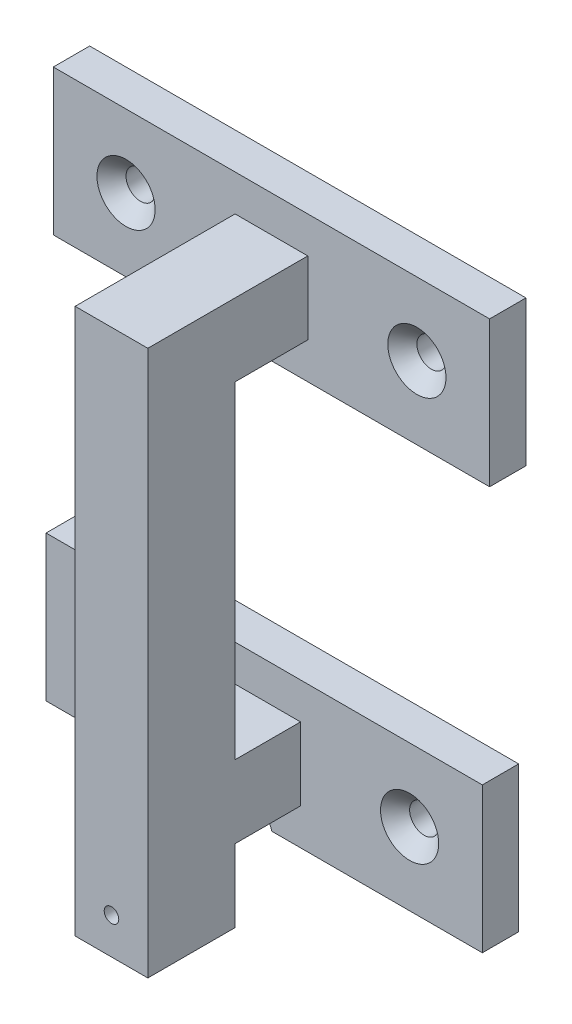
ISO-10303-21;
HEADER;
FILE_DESCRIPTION(('STEP AP214'),'2;1');
FILE_NAME('part.step','',(''),(''),'','','');
FILE_SCHEMA(('AUTOMOTIVE_DESIGN { 1 0 10303 214 1 1 1 1 }'));
ENDSEC;
DATA;
#1=APPLICATION_CONTEXT('core data for automotive mechanical design processes');
#2=APPLICATION_PROTOCOL_DEFINITION('international standard','automotive_design',2000,#1);
#3=PRODUCT_CONTEXT('',#1,'mechanical');
#4=PRODUCT('Part','Part','',(#3));
#5=PRODUCT_RELATED_PRODUCT_CATEGORY('part','',(#4));
#6=PRODUCT_DEFINITION_FORMATION('','',#4);
#7=PRODUCT_DEFINITION_CONTEXT('part definition',#1,'design');
#8=PRODUCT_DEFINITION('design','',#6,#7);
#9=PRODUCT_DEFINITION_SHAPE('','',#8);
#10=(LENGTH_UNIT() NAMED_UNIT(*) SI_UNIT(.MILLI.,.METRE.));
#11=(NAMED_UNIT(*) PLANE_ANGLE_UNIT() SI_UNIT($,.RADIAN.));
#12=(NAMED_UNIT(*) SI_UNIT($,.STERADIAN.) SOLID_ANGLE_UNIT());
#13=UNCERTAINTY_MEASURE_WITH_UNIT(LENGTH_MEASURE(1.E-05),#10,'distance_accuracy_value','');
#14=(GEOMETRIC_REPRESENTATION_CONTEXT(3) GLOBAL_UNCERTAINTY_ASSIGNED_CONTEXT((#13)) GLOBAL_UNIT_ASSIGNED_CONTEXT((#10,
#11,#12)) REPRESENTATION_CONTEXT('',''));
#15=CARTESIAN_POINT('',(0.,0.,0.));
#16=DIRECTION('',(0.,0.,1.));
#17=DIRECTION('',(1.,0.,0.));
#18=AXIS2_PLACEMENT_3D('',#15,#16,#17);
#19=CARTESIAN_POINT('',(-5.,60.,-6.));
#20=DIRECTION('',(0.,0.,-1.));
#21=DIRECTION('',(-1.,0.,0.));
#22=AXIS2_PLACEMENT_3D('',#19,#20,#21);
#23=PLANE('',#22);
#24=DIRECTION('',(0.,-1.,0.));
#25=VECTOR('',#24,1.);
#26=CARTESIAN_POINT('',(-5.,60.,-6.));
#27=LINE('',#26,#25);
#28=CARTESIAN_POINT('',(-5.,50.,-6.));
#29=VERTEX_POINT('',#28);
#30=CARTESIAN_POINT('',(-5.,5.,-6.));
#31=VERTEX_POINT('',#30);
#32=EDGE_CURVE('E50',#29,#31,#27,.T.);
#33=ORIENTED_EDGE('',*,*,#32,.F.);
#34=DIRECTION('',(-1.,0.,0.));
#35=VECTOR('',#34,1.);
#36=CARTESIAN_POINT('',(5.,50.,-6.));
#37=LINE('',#36,#35);
#38=CARTESIAN_POINT('',(5.,50.,-6.));
#39=VERTEX_POINT('',#38);
#40=EDGE_CURVE('E54',#39,#29,#37,.T.);
#41=ORIENTED_EDGE('',*,*,#40,.F.);
#42=DIRECTION('',(0.,-1.,0.));
#43=VECTOR('',#42,1.);
#44=CARTESIAN_POINT('',(5.,60.,-6.));
#45=LINE('',#44,#43);
#46=CARTESIAN_POINT('',(5.,5.,-6.));
#47=VERTEX_POINT('',#46);
#48=EDGE_CURVE('E365',#39,#47,#45,.T.);
#49=ORIENTED_EDGE('',*,*,#48,.T.);
#50=DIRECTION('',(-1.,0.,0.));
#51=VECTOR('',#50,1.);
#52=CARTESIAN_POINT('',(0.,5.,-6.));
#53=LINE('',#52,#51);
#54=EDGE_CURVE('E367',#47,#31,#53,.T.);
#55=ORIENTED_EDGE('',*,*,#54,.T.);
#56=EDGE_LOOP('',(#33,#41,#49,#55));
#57=FACE_BOUND('',#56,.T.);
#58=ADVANCED_FACE('F35',(#57),#23,.T.);
#59=CARTESIAN_POINT('',(30.,-10.,-15.));
#60=DIRECTION('',(0.,-1.,0.));
#61=DIRECTION('',(0.,0.,-1.));
#62=AXIS2_PLACEMENT_3D('',#59,#60,#61);
#63=PLANE('',#62);
#64=DIRECTION('',(0.,0.,1.));
#65=VECTOR('',#64,1.);
#66=CARTESIAN_POINT('',(1.,-10.,-20.));
#67=LINE('',#66,#65);
#68=CARTESIAN_POINT('',(1.,-10.,-20.));
#69=VERTEX_POINT('',#68);
#70=CARTESIAN_POINT('',(1.,-10.,-15.));
#71=VERTEX_POINT('',#70);
#72=EDGE_CURVE('E285',#69,#71,#67,.T.);
#73=ORIENTED_EDGE('',*,*,#72,.F.);
#74=DIRECTION('',(-1.,0.,0.));
#75=VECTOR('',#74,1.);
#76=CARTESIAN_POINT('',(30.,-10.,-20.));
#77=LINE('',#76,#75);
#78=CARTESIAN_POINT('',(30.,-10.,-20.));
#79=VERTEX_POINT('',#78);
#80=EDGE_CURVE('E389',#79,#69,#77,.T.);
#81=ORIENTED_EDGE('',*,*,#80,.F.);
#82=DIRECTION('',(0.,0.,-1.));
#83=VECTOR('',#82,1.);
#84=CARTESIAN_POINT('',(30.,-10.,-15.));
#85=LINE('',#84,#83);
#86=CARTESIAN_POINT('',(30.,-10.,-15.));
#87=VERTEX_POINT('',#86);
#88=EDGE_CURVE('E415',#87,#79,#85,.T.);
#89=ORIENTED_EDGE('',*,*,#88,.F.);
#90=DIRECTION('',(-1.,0.,0.));
#91=VECTOR('',#90,1.);
#92=CARTESIAN_POINT('',(30.,-10.,-15.));
#93=LINE('',#92,#91);
#94=EDGE_CURVE('E396',#87,#71,#93,.T.);
#95=ORIENTED_EDGE('',*,*,#94,.T.);
#96=EDGE_LOOP('',(#73,#81,#89,#95));
#97=FACE_BOUND('',#96,.T.);
#98=ADVANCED_FACE('F514',(#97),#63,.T.);
#99=CARTESIAN_POINT('',(0.,-5.,5.));
#100=DIRECTION('',(0.,1.,0.));
#101=DIRECTION('',(0.,0.,1.));
#102=AXIS2_PLACEMENT_3D('',#99,#100,#101);
#103=PLANE('',#102);
#104=DIRECTION('',(0.,0.,-1.));
#105=VECTOR('',#104,1.);
#106=CARTESIAN_POINT('',(5.,-5.,5.));
#107=LINE('',#106,#105);
#108=CARTESIAN_POINT('',(5.,-5.,-6.));
#109=VERTEX_POINT('',#108);
#110=CARTESIAN_POINT('',(5.,-5.,-15.));
#111=VERTEX_POINT('',#110);
#112=EDGE_CURVE('E434',#109,#111,#107,.T.);
#113=ORIENTED_EDGE('',*,*,#112,.F.);
#114=DIRECTION('',(-1.,0.,0.));
#115=VECTOR('',#114,1.);
#116=CARTESIAN_POINT('',(0.,-5.,-6.));
#117=LINE('',#116,#115);
#118=CARTESIAN_POINT('',(-5.,-5.,-6.));
#119=VERTEX_POINT('',#118);
#120=EDGE_CURVE('E375',#109,#119,#117,.T.);
#121=ORIENTED_EDGE('',*,*,#120,.T.);
#122=DIRECTION('',(0.,0.,-1.));
#123=VECTOR('',#122,1.);
#124=CARTESIAN_POINT('',(-5.,-5.,5.));
#125=LINE('',#124,#123);
#126=CARTESIAN_POINT('',(-5.,-5.,-15.));
#127=VERTEX_POINT('',#126);
#128=EDGE_CURVE('E428',#119,#127,#125,.T.);
#129=ORIENTED_EDGE('',*,*,#128,.T.);
#130=DIRECTION('',(1.,0.,0.));
#131=VECTOR('',#130,1.);
#132=CARTESIAN_POINT('',(0.,-5.,-15.));
#133=LINE('',#132,#131);
#134=EDGE_CURVE('E425',#127,#111,#133,.T.);
#135=ORIENTED_EDGE('',*,*,#134,.T.);
#136=EDGE_LOOP('',(#113,#121,#129,#135));
#137=FACE_BOUND('',#136,.T.);
#138=ADVANCED_FACE('F520',(#137),#103,.F.);
#139=CARTESIAN_POINT('',(5.,0.,5.));
#140=DIRECTION('',(-1.,0.,0.));
#141=DIRECTION('',(0.,0.,1.));
#142=AXIS2_PLACEMENT_3D('',#139,#140,#141);
#143=PLANE('',#142);
#144=CARTESIAN_POINT('',(5.,-15.,-6.));
#145=VERTEX_POINT('',#144);
#146=EDGE_CURVE('E368',#109,#145,#45,.T.);
#147=ORIENTED_EDGE('',*,*,#146,.F.);
#148=ORIENTED_EDGE('',*,*,#112,.T.);
#149=DIRECTION('',(0.,1.,0.));
#150=VECTOR('',#149,1.);
#151=CARTESIAN_POINT('',(5.,0.,-15.));
#152=LINE('',#151,#150);
#153=CARTESIAN_POINT('',(5.,5.,-15.));
#154=VERTEX_POINT('',#153);
#155=EDGE_CURVE('E422',#111,#154,#152,.T.);
#156=ORIENTED_EDGE('',*,*,#155,.T.);
#157=DIRECTION('',(0.,0.,-1.));
#158=VECTOR('',#157,1.);
#159=CARTESIAN_POINT('',(5.,5.,5.));
#160=LINE('',#159,#158);
#161=EDGE_CURVE('E432',#47,#154,#160,.T.);
#162=ORIENTED_EDGE('',*,*,#161,.F.);
#163=ORIENTED_EDGE('',*,*,#48,.F.);
#164=DIRECTION('',(0.,0.,1.));
#165=VECTOR('',#164,1.);
#166=CARTESIAN_POINT('',(5.,50.,-16.));
#167=LINE('',#166,#165);
#168=CARTESIAN_POINT('',(5.,50.,-16.));
#169=VERTEX_POINT('',#168);
#170=EDGE_CURVE('E265',#169,#39,#167,.T.);
#171=ORIENTED_EDGE('',*,*,#170,.F.);
#172=DIRECTION('',(0.,-1.,0.));
#173=VECTOR('',#172,1.);
#174=CARTESIAN_POINT('',(5.,50.,-16.));
#175=LINE('',#174,#173);
#176=CARTESIAN_POINT('',(5.,60.,-16.));
#177=VERTEX_POINT('',#176);
#178=EDGE_CURVE('E256',#177,#169,#175,.T.);
#179=ORIENTED_EDGE('',*,*,#178,.F.);
#180=DIRECTION('',(0.,0.,1.));
#181=VECTOR('',#180,1.);
#182=CARTESIAN_POINT('',(5.,60.,-6.));
#183=LINE('',#182,#181);
#184=CARTESIAN_POINT('',(5.,60.,6.));
#185=VERTEX_POINT('',#184);
#186=EDGE_CURVE('E356',#177,#185,#183,.T.);
#187=ORIENTED_EDGE('',*,*,#186,.T.);
#188=DIRECTION('',(0.,-1.,0.));
#189=VECTOR('',#188,1.);
#190=CARTESIAN_POINT('',(5.,60.,6.));
#191=LINE('',#190,#189);
#192=CARTESIAN_POINT('',(5.,-15.,6.));
#193=VERTEX_POINT('',#192);
#194=EDGE_CURVE('E364',#185,#193,#191,.T.);
#195=ORIENTED_EDGE('',*,*,#194,.T.);
#196=DIRECTION('',(0.,0.,1.));
#197=VECTOR('',#196,1.);
#198=CARTESIAN_POINT('',(5.,-15.,-6.));
#199=LINE('',#198,#197);
#200=EDGE_CURVE('E330',#145,#193,#199,.T.);
#201=ORIENTED_EDGE('',*,*,#200,.F.);
#202=EDGE_LOOP('',(#147,#148,#156,#162,#163,#171,#179,#187,#195,#201));
#203=FACE_BOUND('',#202,.T.);
#204=ADVANCED_FACE('F548',(#203),#143,.F.);
#205=CARTESIAN_POINT('',(0.,5.,5.));
#206=DIRECTION('',(0.,1.,0.));
#207=DIRECTION('',(0.,0.,1.));
#208=AXIS2_PLACEMENT_3D('',#205,#206,#207);
#209=PLANE('',#208);
#210=ORIENTED_EDGE('',*,*,#54,.F.);
#211=ORIENTED_EDGE('',*,*,#161,.T.);
#212=DIRECTION('',(1.,0.,0.));
#213=VECTOR('',#212,1.);
#214=CARTESIAN_POINT('',(0.,5.,-15.));
#215=LINE('',#214,#213);
#216=CARTESIAN_POINT('',(-5.,5.,-15.));
#217=VERTEX_POINT('',#216);
#218=EDGE_CURVE('E414',#217,#154,#215,.T.);
#219=ORIENTED_EDGE('',*,*,#218,.F.);
#220=DIRECTION('',(0.,0.,-1.));
#221=VECTOR('',#220,1.);
#222=CARTESIAN_POINT('',(-5.,5.,5.));
#223=LINE('',#222,#221);
#224=EDGE_CURVE('E430',#31,#217,#223,.T.);
#225=ORIENTED_EDGE('',*,*,#224,.F.);
#226=EDGE_LOOP('',(#210,#211,#219,#225));
#227=FACE_BOUND('',#226,.T.);
#228=ADVANCED_FACE('F558',(#227),#209,.T.);
#229=CARTESIAN_POINT('',(-5.,0.,5.));
#230=DIRECTION('',(-1.,0.,0.));
#231=DIRECTION('',(0.,0.,1.));
#232=AXIS2_PLACEMENT_3D('',#229,#230,#231);
#233=PLANE('',#232);
#234=ORIENTED_EDGE('',*,*,#128,.F.);
#235=CARTESIAN_POINT('',(-5.,-15.,-6.));
#236=VERTEX_POINT('',#235);
#237=EDGE_CURVE('E370',#119,#236,#27,.T.);
#238=ORIENTED_EDGE('',*,*,#237,.T.);
#239=DIRECTION('',(0.,0.,-1.));
#240=VECTOR('',#239,1.);
#241=CARTESIAN_POINT('',(-5.,-15.,-6.));
#242=LINE('',#241,#240);
#243=CARTESIAN_POINT('',(-5.,-15.,6.));
#244=VERTEX_POINT('',#243);
#245=EDGE_CURVE('E350',#244,#236,#242,.T.);
#246=ORIENTED_EDGE('',*,*,#245,.F.);
#247=DIRECTION('',(0.,-1.,0.));
#248=VECTOR('',#247,1.);
#249=CARTESIAN_POINT('',(-5.,60.,6.));
#250=LINE('',#249,#248);
#251=CARTESIAN_POINT('',(-5.,60.,6.));
#252=VERTEX_POINT('',#251);
#253=EDGE_CURVE('E371',#252,#244,#250,.T.);
#254=ORIENTED_EDGE('',*,*,#253,.F.);
#255=DIRECTION('',(0.,0.,-1.));
#256=VECTOR('',#255,1.);
#257=CARTESIAN_POINT('',(-5.,60.,-6.));
#258=LINE('',#257,#256);
#259=CARTESIAN_POINT('',(-5.,60.,-16.));
#260=VERTEX_POINT('',#259);
#261=EDGE_CURVE('E362',#252,#260,#258,.T.);
#262=ORIENTED_EDGE('',*,*,#261,.T.);
#263=DIRECTION('',(0.,1.,0.));
#264=VECTOR('',#263,1.);
#265=CARTESIAN_POINT('',(-5.,50.,-16.));
#266=LINE('',#265,#264);
#267=CARTESIAN_POINT('',(-5.,50.,-16.));
#268=VERTEX_POINT('',#267);
#269=EDGE_CURVE('E245',#268,#260,#266,.T.);
#270=ORIENTED_EDGE('',*,*,#269,.F.);
#271=DIRECTION('',(0.,0.,1.));
#272=VECTOR('',#271,1.);
#273=CARTESIAN_POINT('',(-5.,50.,-16.));
#274=LINE('',#273,#272);
#275=EDGE_CURVE('E261',#268,#29,#274,.T.);
#276=ORIENTED_EDGE('',*,*,#275,.T.);
#277=ORIENTED_EDGE('',*,*,#32,.T.);
#278=ORIENTED_EDGE('',*,*,#224,.T.);
#279=DIRECTION('',(0.,1.,0.));
#280=VECTOR('',#279,1.);
#281=CARTESIAN_POINT('',(-5.,0.,-15.));
#282=LINE('',#281,#280);
#283=EDGE_CURVE('E436',#127,#217,#282,.T.);
#284=ORIENTED_EDGE('',*,*,#283,.F.);
#285=EDGE_LOOP('',(#234,#238,#246,#254,#262,#270,#276,#277,#278,#284));
#286=FACE_BOUND('',#285,.T.);
#287=ADVANCED_FACE('F561',(#286),#233,.T.);
#288=CARTESIAN_POINT('',(0.,0.,-15.));
#289=DIRECTION('',(0.,0.,1.));
#290=DIRECTION('',(1.,0.,0.));
#291=AXIS2_PLACEMENT_3D('',#288,#289,#290);
#292=PLANE('',#291);
#293=CARTESIAN_POINT('',(-20.,0.,-15.));
#294=DIRECTION('',(0.,0.,1.));
#295=DIRECTION('',(1.,0.,0.));
#296=AXIS2_PLACEMENT_3D('',#293,#294,#295);
#297=CIRCLE('',#296,4.);
#298=CARTESIAN_POINT('',(-16.,0.,-15.));
#299=VERTEX_POINT('',#298);
#300=EDGE_CURVE('E444',#299,#299,#297,.F.);
#301=ORIENTED_EDGE('',*,*,#300,.T.);
#302=EDGE_LOOP('',(#301));
#303=FACE_BOUND('',#302,.T.);
#304=CARTESIAN_POINT('',(20.,0.,-15.));
#305=DIRECTION('',(0.,0.,1.));
#306=DIRECTION('',(1.,0.,0.));
#307=AXIS2_PLACEMENT_3D('',#304,#305,#306);
#308=CIRCLE('',#307,4.);
#309=CARTESIAN_POINT('',(24.,0.,-15.));
#310=VERTEX_POINT('',#309);
#311=EDGE_CURVE('E439',#310,#310,#308,.F.);
#312=ORIENTED_EDGE('',*,*,#311,.T.);
#313=EDGE_LOOP('',(#312));
#314=FACE_BOUND('',#313,.T.);
#315=CARTESIAN_POINT('',(0.,-10.,-15.));
#316=DIRECTION('',(0.,0.,1.));
#317=DIRECTION('',(1.,0.,0.));
#318=AXIS2_PLACEMENT_3D('',#315,#316,#317);
#319=CIRCLE('',#318,1.);
#320=CARTESIAN_POINT('',(-0.999999999999999,-10.,-15.));
#321=VERTEX_POINT('',#320);
#322=EDGE_CURVE('E283',#71,#321,#319,.T.);
#323=ORIENTED_EDGE('',*,*,#322,.F.);
#324=ORIENTED_EDGE('',*,*,#94,.F.);
#325=DIRECTION('',(0.,-1.,0.));
#326=VECTOR('',#325,1.);
#327=CARTESIAN_POINT('',(30.,-10.,-15.));
#328=LINE('',#327,#326);
#329=CARTESIAN_POINT('',(30.,10.,-15.));
#330=VERTEX_POINT('',#329);
#331=EDGE_CURVE('E392',#330,#87,#328,.T.);
#332=ORIENTED_EDGE('',*,*,#331,.F.);
#333=DIRECTION('',(1.,0.,0.));
#334=VECTOR('',#333,1.);
#335=CARTESIAN_POINT('',(30.,10.,-15.));
#336=LINE('',#335,#334);
#337=CARTESIAN_POINT('',(-30.,10.,-15.));
#338=VERTEX_POINT('',#337);
#339=EDGE_CURVE('E388',#338,#330,#336,.T.);
#340=ORIENTED_EDGE('',*,*,#339,.F.);
#341=DIRECTION('',(0.,1.,0.));
#342=VECTOR('',#341,1.);
#343=CARTESIAN_POINT('',(-30.,-10.,-15.));
#344=LINE('',#343,#342);
#345=CARTESIAN_POINT('',(-30.,-10.,-15.));
#346=VERTEX_POINT('',#345);
#347=EDGE_CURVE('E385',#346,#338,#344,.T.);
#348=ORIENTED_EDGE('',*,*,#347,.F.);
#349=EDGE_CURVE('E395',#321,#346,#93,.T.);
#350=ORIENTED_EDGE('',*,*,#349,.F.);
#351=EDGE_LOOP('',(#323,#324,#332,#340,#348,#350));
#352=FACE_BOUND('',#351,.T.);
#353=ORIENTED_EDGE('',*,*,#134,.F.);
#354=ORIENTED_EDGE('',*,*,#283,.T.);
#355=ORIENTED_EDGE('',*,*,#218,.T.);
#356=ORIENTED_EDGE('',*,*,#155,.F.);
#357=EDGE_LOOP('',(#353,#354,#355,#356));
#358=FACE_BOUND('',#357,.T.);
#359=ADVANCED_FACE('F553',(#303,#314,#352,#358),#292,.T.);
#360=CARTESIAN_POINT('',(-30.,-10.,-15.));
#361=DIRECTION('',(-1.,0.,0.));
#362=DIRECTION('',(0.,0.,1.));
#363=AXIS2_PLACEMENT_3D('',#360,#361,#362);
#364=PLANE('',#363);
#365=DIRECTION('',(0.,1.,0.));
#366=VECTOR('',#365,1.);
#367=CARTESIAN_POINT('',(-30.,-10.,-20.));
#368=LINE('',#367,#366);
#369=CARTESIAN_POINT('',(-30.,-10.,-20.));
#370=VERTEX_POINT('',#369);
#371=CARTESIAN_POINT('',(-30.,10.,-20.));
#372=VERTEX_POINT('',#371);
#373=EDGE_CURVE('E384',#370,#372,#368,.T.);
#374=ORIENTED_EDGE('',*,*,#373,.F.);
#375=DIRECTION('',(0.,0.,-1.));
#376=VECTOR('',#375,1.);
#377=CARTESIAN_POINT('',(-30.,-10.,-15.));
#378=LINE('',#377,#376);
#379=EDGE_CURVE('E411',#346,#370,#378,.T.);
#380=ORIENTED_EDGE('',*,*,#379,.F.);
#381=ORIENTED_EDGE('',*,*,#347,.T.);
#382=DIRECTION('',(0.,0.,-1.));
#383=VECTOR('',#382,1.);
#384=CARTESIAN_POINT('',(-30.,10.,-15.));
#385=LINE('',#384,#383);
#386=EDGE_CURVE('E399',#338,#372,#385,.T.);
#387=ORIENTED_EDGE('',*,*,#386,.T.);
#388=EDGE_LOOP('',(#374,#380,#381,#387));
#389=FACE_BOUND('',#388,.T.);
#390=ADVANCED_FACE('F658',(#389),#364,.T.);
#391=DIRECTION('',(0.,0.,1.));
#392=VECTOR('',#391,1.);
#393=CARTESIAN_POINT('',(-0.999999999999999,-10.,-20.));
#394=LINE('',#393,#392);
#395=CARTESIAN_POINT('',(-0.999999999999999,-10.,-20.));
#396=VERTEX_POINT('',#395);
#397=EDGE_CURVE('E281',#321,#396,#394,.F.);
#398=ORIENTED_EDGE('',*,*,#397,.F.);
#399=ORIENTED_EDGE('',*,*,#349,.T.);
#400=ORIENTED_EDGE('',*,*,#379,.T.);
#401=EDGE_CURVE('E408',#396,#370,#77,.T.);
#402=ORIENTED_EDGE('',*,*,#401,.F.);
#403=EDGE_LOOP('',(#398,#399,#400,#402));
#404=FACE_BOUND('',#403,.T.);
#405=ADVANCED_FACE('F523',(#404),#63,.T.);
#406=CARTESIAN_POINT('',(30.,-10.,-15.));
#407=DIRECTION('',(1.,0.,0.));
#408=DIRECTION('',(0.,0.,-1.));
#409=AXIS2_PLACEMENT_3D('',#406,#407,#408);
#410=PLANE('',#409);
#411=DIRECTION('',(0.,-1.,0.));
#412=VECTOR('',#411,1.);
#413=CARTESIAN_POINT('',(30.,-10.,-20.));
#414=LINE('',#413,#412);
#415=CARTESIAN_POINT('',(30.,10.,-20.));
#416=VERTEX_POINT('',#415);
#417=EDGE_CURVE('E405',#416,#79,#414,.T.);
#418=ORIENTED_EDGE('',*,*,#417,.F.);
#419=DIRECTION('',(0.,0.,-1.));
#420=VECTOR('',#419,1.);
#421=CARTESIAN_POINT('',(30.,10.,-15.));
#422=LINE('',#421,#420);
#423=EDGE_CURVE('E417',#330,#416,#422,.T.);
#424=ORIENTED_EDGE('',*,*,#423,.F.);
#425=ORIENTED_EDGE('',*,*,#331,.T.);
#426=ORIENTED_EDGE('',*,*,#88,.T.);
#427=EDGE_LOOP('',(#418,#424,#425,#426));
#428=FACE_BOUND('',#427,.T.);
#429=ADVANCED_FACE('F666',(#428),#410,.T.);
#430=CARTESIAN_POINT('',(30.,10.,-15.));
#431=DIRECTION('',(0.,1.,0.));
#432=DIRECTION('',(0.,0.,1.));
#433=AXIS2_PLACEMENT_3D('',#430,#431,#432);
#434=PLANE('',#433);
#435=DIRECTION('',(1.,0.,0.));
#436=VECTOR('',#435,1.);
#437=CARTESIAN_POINT('',(30.,10.,-20.));
#438=LINE('',#437,#436);
#439=EDGE_CURVE('E402',#372,#416,#438,.T.);
#440=ORIENTED_EDGE('',*,*,#439,.F.);
#441=ORIENTED_EDGE('',*,*,#386,.F.);
#442=ORIENTED_EDGE('',*,*,#339,.T.);
#443=ORIENTED_EDGE('',*,*,#423,.T.);
#444=EDGE_LOOP('',(#440,#441,#442,#443));
#445=FACE_BOUND('',#444,.T.);
#446=ADVANCED_FACE('F662',(#445),#434,.T.);
#447=CARTESIAN_POINT('',(-20.,0.,-15.));
#448=DIRECTION('',(0.,0.,-1.));
#449=DIRECTION('',(-1.,0.,0.));
#450=AXIS2_PLACEMENT_3D('',#447,#448,#449);
#451=CYLINDRICAL_SURFACE('',#450,2.);
#452=CARTESIAN_POINT('',(-20.,0.,-17.));
#453=DIRECTION('',(0.,0.,1.));
#454=DIRECTION('',(1.,0.,0.));
#455=AXIS2_PLACEMENT_3D('',#452,#453,#454);
#456=CIRCLE('',#455,2.);
#457=CARTESIAN_POINT('',(-18.,0.,-17.));
#458=VERTEX_POINT('',#457);
#459=EDGE_CURVE('E447',#458,#458,#456,.T.);
#460=ORIENTED_EDGE('',*,*,#459,.T.);
#461=EDGE_LOOP('',(#460));
#462=FACE_BOUND('',#461,.T.);
#463=CARTESIAN_POINT('',(-20.,0.,-20.));
#464=DIRECTION('',(0.,0.,-1.));
#465=DIRECTION('',(-1.,0.,0.));
#466=AXIS2_PLACEMENT_3D('',#463,#464,#465);
#467=CIRCLE('',#466,2.);
#468=CARTESIAN_POINT('',(-22.,0.,-20.));
#469=VERTEX_POINT('',#468);
#470=EDGE_CURVE('E381',#469,#469,#467,.T.);
#471=ORIENTED_EDGE('',*,*,#470,.T.);
#472=EDGE_LOOP('',(#471));
#473=FACE_BOUND('',#472,.T.);
#474=ADVANCED_FACE('F665',(#462,#473),#451,.F.);
#475=CARTESIAN_POINT('',(20.,0.,-15.));
#476=DIRECTION('',(0.,0.,-1.));
#477=DIRECTION('',(-1.,0.,0.));
#478=AXIS2_PLACEMENT_3D('',#475,#476,#477);
#479=CYLINDRICAL_SURFACE('',#478,2.);
#480=CARTESIAN_POINT('',(20.,0.,-17.));
#481=DIRECTION('',(0.,0.,1.));
#482=DIRECTION('',(1.,0.,0.));
#483=AXIS2_PLACEMENT_3D('',#480,#481,#482);
#484=CIRCLE('',#483,2.);
#485=CARTESIAN_POINT('',(22.,0.,-17.));
#486=VERTEX_POINT('',#485);
#487=EDGE_CURVE('E11',#486,#486,#484,.T.);
#488=ORIENTED_EDGE('',*,*,#487,.T.);
#489=EDGE_LOOP('',(#488));
#490=FACE_BOUND('',#489,.T.);
#491=CARTESIAN_POINT('',(20.,0.,-20.));
#492=DIRECTION('',(0.,0.,-1.));
#493=DIRECTION('',(1.,0.,0.));
#494=AXIS2_PLACEMENT_3D('',#491,#492,#493);
#495=CIRCLE('',#494,2.);
#496=CARTESIAN_POINT('',(22.,0.,-20.));
#497=VERTEX_POINT('',#496);
#498=EDGE_CURVE('E378',#497,#497,#495,.T.);
#499=ORIENTED_EDGE('',*,*,#498,.T.);
#500=EDGE_LOOP('',(#499));
#501=FACE_BOUND('',#500,.T.);
#502=ADVANCED_FACE('F536',(#490,#501),#479,.F.);
#503=CARTESIAN_POINT('',(0.,0.,-20.));
#504=DIRECTION('',(0.,0.,1.));
#505=DIRECTION('',(1.,0.,0.));
#506=AXIS2_PLACEMENT_3D('',#503,#504,#505);
#507=PLANE('',#506);
#508=ORIENTED_EDGE('',*,*,#498,.F.);
#509=EDGE_LOOP('',(#508));
#510=FACE_BOUND('',#509,.T.);
#511=ORIENTED_EDGE('',*,*,#470,.F.);
#512=EDGE_LOOP('',(#511));
#513=FACE_BOUND('',#512,.T.);
#514=ORIENTED_EDGE('',*,*,#80,.T.);
#515=CARTESIAN_POINT('',(0.,-10.,-20.));
#516=DIRECTION('',(0.,0.,1.));
#517=DIRECTION('',(1.,0.,0.));
#518=AXIS2_PLACEMENT_3D('',#515,#516,#517);
#519=CIRCLE('',#518,1.);
#520=EDGE_CURVE('E269',#69,#396,#519,.T.);
#521=ORIENTED_EDGE('',*,*,#520,.T.);
#522=ORIENTED_EDGE('',*,*,#401,.T.);
#523=ORIENTED_EDGE('',*,*,#373,.T.);
#524=ORIENTED_EDGE('',*,*,#439,.T.);
#525=ORIENTED_EDGE('',*,*,#417,.T.);
#526=EDGE_LOOP('',(#514,#521,#522,#523,#524,#525));
#527=FACE_BOUND('',#526,.T.);
#528=ADVANCED_FACE('F528',(#510,#513,#527),#507,.F.);
#529=CARTESIAN_POINT('',(0.,-10.,-6.));
#530=DIRECTION('',(0.,0.,-1.));
#531=DIRECTION('',(-1.,0.,0.));
#532=AXIS2_PLACEMENT_3D('',#529,#530,#531);
#533=CIRCLE('',#532,1.);
#534=CARTESIAN_POINT('',(-0.999999999999999,-10.,-6.));
#535=VERTEX_POINT('',#534);
#536=EDGE_CURVE('E278',#535,#535,#533,.T.);
#537=ORIENTED_EDGE('',*,*,#536,.F.);
#538=EDGE_LOOP('',(#537));
#539=FACE_BOUND('',#538,.T.);
#540=ORIENTED_EDGE('',*,*,#120,.F.);
#541=ORIENTED_EDGE('',*,*,#146,.T.);
#542=DIRECTION('',(1.,0.,0.));
#543=VECTOR('',#542,1.);
#544=CARTESIAN_POINT('',(-5.,-15.,-6.));
#545=LINE('',#544,#543);
#546=EDGE_CURVE('E353',#236,#145,#545,.T.);
#547=ORIENTED_EDGE('',*,*,#546,.F.);
#548=ORIENTED_EDGE('',*,*,#237,.F.);
#549=EDGE_LOOP('',(#540,#541,#547,#548));
#550=FACE_BOUND('',#549,.T.);
#551=ADVANCED_FACE('F516',(#539,#550),#23,.T.);
#552=CARTESIAN_POINT('',(-5.,60.,6.));
#553=DIRECTION('',(0.,0.,1.));
#554=DIRECTION('',(1.,0.,0.));
#555=AXIS2_PLACEMENT_3D('',#552,#553,#554);
#556=PLANE('',#555);
#557=CARTESIAN_POINT('',(0.,-10.,6.));
#558=DIRECTION('',(0.,0.,1.));
#559=DIRECTION('',(1.,0.,0.));
#560=AXIS2_PLACEMENT_3D('',#557,#558,#559);
#561=CIRCLE('',#560,1.);
#562=CARTESIAN_POINT('',(1.,-10.,6.));
#563=VERTEX_POINT('',#562);
#564=EDGE_CURVE('E268',#563,#563,#561,.T.);
#565=ORIENTED_EDGE('',*,*,#564,.F.);
#566=EDGE_LOOP('',(#565));
#567=FACE_BOUND('',#566,.T.);
#568=ORIENTED_EDGE('',*,*,#253,.T.);
#569=DIRECTION('',(-1.,0.,0.));
#570=VECTOR('',#569,1.);
#571=CARTESIAN_POINT('',(-5.,-15.,6.));
#572=LINE('',#571,#570);
#573=EDGE_CURVE('E347',#193,#244,#572,.T.);
#574=ORIENTED_EDGE('',*,*,#573,.F.);
#575=ORIENTED_EDGE('',*,*,#194,.F.);
#576=DIRECTION('',(-1.,0.,0.));
#577=VECTOR('',#576,1.);
#578=CARTESIAN_POINT('',(-5.,60.,6.));
#579=LINE('',#578,#577);
#580=EDGE_CURVE('E359',#185,#252,#579,.T.);
#581=ORIENTED_EDGE('',*,*,#580,.T.);
#582=EDGE_LOOP('',(#568,#574,#575,#581));
#583=FACE_BOUND('',#582,.T.);
#584=ADVANCED_FACE('F527',(#567,#583),#556,.T.);
#585=CARTESIAN_POINT('',(0.,60.,0.));
#586=DIRECTION('',(0.,1.,0.));
#587=DIRECTION('',(0.,0.,1.));
#588=AXIS2_PLACEMENT_3D('',#585,#586,#587);
#589=PLANE('',#588);
#590=ORIENTED_EDGE('',*,*,#186,.F.);
#591=DIRECTION('',(1.,0.,0.));
#592=VECTOR('',#591,1.);
#593=CARTESIAN_POINT('',(5.,60.,-16.));
#594=LINE('',#593,#592);
#595=EDGE_CURVE('E253',#260,#177,#594,.T.);
#596=ORIENTED_EDGE('',*,*,#595,.F.);
#597=ORIENTED_EDGE('',*,*,#261,.F.);
#598=ORIENTED_EDGE('',*,*,#580,.F.);
#599=EDGE_LOOP('',(#590,#596,#597,#598));
#600=FACE_BOUND('',#599,.T.);
#601=ADVANCED_FACE('F534',(#600),#589,.T.);
#602=CARTESIAN_POINT('',(0.,-15.,0.));
#603=DIRECTION('',(0.,1.,0.));
#604=DIRECTION('',(0.,0.,1.));
#605=AXIS2_PLACEMENT_3D('',#602,#603,#604);
#606=PLANE('',#605);
#607=DIRECTION('',(0.,0.,1.));
#608=VECTOR('',#607,1.);
#609=CARTESIAN_POINT('',(2.05,-15.,0.));
#610=LINE('',#609,#608);
#611=CARTESIAN_POINT('',(2.05,-15.,-1.55));
#612=VERTEX_POINT('',#611);
#613=CARTESIAN_POINT('',(2.05,-15.,-1.05));
#614=VERTEX_POINT('',#613);
#615=EDGE_CURVE('E310',#612,#614,#610,.T.);
#616=ORIENTED_EDGE('',*,*,#615,.F.);
#617=DIRECTION('',(1.,0.,0.));
#618=VECTOR('',#617,1.);
#619=CARTESIAN_POINT('',(0.,-15.,-1.55));
#620=LINE('',#619,#618);
#621=CARTESIAN_POINT('',(-2.05,-15.,-1.55));
#622=VERTEX_POINT('',#621);
#623=EDGE_CURVE('E287',#622,#612,#620,.T.);
#624=ORIENTED_EDGE('',*,*,#623,.F.);
#625=DIRECTION('',(0.,0.,1.));
#626=VECTOR('',#625,1.);
#627=CARTESIAN_POINT('',(-2.05,-15.,0.));
#628=LINE('',#627,#626);
#629=CARTESIAN_POINT('',(-2.05,-15.,1.55));
#630=VERTEX_POINT('',#629);
#631=EDGE_CURVE('E292',#622,#630,#628,.T.);
#632=ORIENTED_EDGE('',*,*,#631,.T.);
#633=DIRECTION('',(1.,0.,0.));
#634=VECTOR('',#633,1.);
#635=CARTESIAN_POINT('',(0.,-15.,1.55));
#636=LINE('',#635,#634);
#637=CARTESIAN_POINT('',(2.05,-15.,1.55));
#638=VERTEX_POINT('',#637);
#639=EDGE_CURVE('E323',#630,#638,#636,.T.);
#640=ORIENTED_EDGE('',*,*,#639,.T.);
#641=CARTESIAN_POINT('',(2.05,-15.,1.05));
#642=VERTEX_POINT('',#641);
#643=EDGE_CURVE('E314',#642,#638,#610,.T.);
#644=ORIENTED_EDGE('',*,*,#643,.F.);
#645=DIRECTION('',(1.,0.,0.));
#646=VECTOR('',#645,1.);
#647=CARTESIAN_POINT('',(0.,-15.,1.05));
#648=LINE('',#647,#646);
#649=CARTESIAN_POINT('',(3.65,-15.,1.05));
#650=VERTEX_POINT('',#649);
#651=EDGE_CURVE('E320',#642,#650,#648,.T.);
#652=ORIENTED_EDGE('',*,*,#651,.T.);
#653=DIRECTION('',(0.,0.,1.));
#654=VECTOR('',#653,1.);
#655=CARTESIAN_POINT('',(3.65,-15.,0.));
#656=LINE('',#655,#654);
#657=CARTESIAN_POINT('',(3.65,-15.,-1.05));
#658=VERTEX_POINT('',#657);
#659=EDGE_CURVE('E317',#658,#650,#656,.T.);
#660=ORIENTED_EDGE('',*,*,#659,.F.);
#661=DIRECTION('',(1.,0.,0.));
#662=VECTOR('',#661,1.);
#663=CARTESIAN_POINT('',(0.,-15.,-1.05));
#664=LINE('',#663,#662);
#665=EDGE_CURVE('E313',#614,#658,#664,.T.);
#666=ORIENTED_EDGE('',*,*,#665,.F.);
#667=EDGE_LOOP('',(#616,#624,#632,#640,#644,#652,#660,#666));
#668=FACE_BOUND('',#667,.T.);
#669=ORIENTED_EDGE('',*,*,#200,.T.);
#670=ORIENTED_EDGE('',*,*,#573,.T.);
#671=ORIENTED_EDGE('',*,*,#245,.T.);
#672=ORIENTED_EDGE('',*,*,#546,.T.);
#673=EDGE_LOOP('',(#669,#670,#671,#672));
#674=FACE_BOUND('',#673,.T.);
#675=ADVANCED_FACE('F572',(#668,#674),#606,.F.);
#676=CARTESIAN_POINT('',(0.,-2.,-1.55));
#677=DIRECTION('',(0.,0.,-1.));
#678=DIRECTION('',(-1.,0.,0.));
#679=AXIS2_PLACEMENT_3D('',#676,#677,#678);
#680=PLANE('',#679);
#681=CARTESIAN_POINT('',(0.,-10.,-1.55));
#682=DIRECTION('',(0.,0.,-1.));
#683=DIRECTION('',(-1.,0.,0.));
#684=AXIS2_PLACEMENT_3D('',#681,#682,#683);
#685=CIRCLE('',#684,1.);
#686=CARTESIAN_POINT('',(-0.999999999999999,-10.,-1.55));
#687=VERTEX_POINT('',#686);
#688=EDGE_CURVE('E275',#687,#687,#685,.T.);
#689=ORIENTED_EDGE('',*,*,#688,.T.);
#690=EDGE_LOOP('',(#689));
#691=FACE_BOUND('',#690,.T.);
#692=ORIENTED_EDGE('',*,*,#623,.T.);
#693=DIRECTION('',(0.,-1.,0.));
#694=VECTOR('',#693,1.);
#695=CARTESIAN_POINT('',(2.05,-2.,-1.55));
#696=LINE('',#695,#694);
#697=CARTESIAN_POINT('',(2.05,-2.,-1.55));
#698=VERTEX_POINT('',#697);
#699=EDGE_CURVE('E308',#698,#612,#696,.T.);
#700=ORIENTED_EDGE('',*,*,#699,.F.);
#701=DIRECTION('',(1.,0.,0.));
#702=VECTOR('',#701,1.);
#703=CARTESIAN_POINT('',(0.,-2.,-1.55));
#704=LINE('',#703,#702);
#705=CARTESIAN_POINT('',(-2.05,-2.,-1.55));
#706=VERTEX_POINT('',#705);
#707=EDGE_CURVE('E288',#706,#698,#704,.T.);
#708=ORIENTED_EDGE('',*,*,#707,.F.);
#709=DIRECTION('',(0.,-1.,0.));
#710=VECTOR('',#709,1.);
#711=CARTESIAN_POINT('',(-2.05,-2.,-1.55));
#712=LINE('',#711,#710);
#713=EDGE_CURVE('E328',#706,#622,#712,.T.);
#714=ORIENTED_EDGE('',*,*,#713,.T.);
#715=EDGE_LOOP('',(#692,#700,#708,#714));
#716=FACE_BOUND('',#715,.T.);
#717=ADVANCED_FACE('F574',(#691,#716),#680,.F.);
#718=CARTESIAN_POINT('',(-2.05,-2.,0.));
#719=DIRECTION('',(1.,0.,0.));
#720=DIRECTION('',(0.,0.,-1.));
#721=AXIS2_PLACEMENT_3D('',#718,#719,#720);
#722=PLANE('',#721);
#723=ORIENTED_EDGE('',*,*,#631,.F.);
#724=ORIENTED_EDGE('',*,*,#713,.F.);
#725=DIRECTION('',(0.,0.,1.));
#726=VECTOR('',#725,1.);
#727=CARTESIAN_POINT('',(-2.05,-2.,0.));
#728=LINE('',#727,#726);
#729=CARTESIAN_POINT('',(-2.05,-2.,1.55));
#730=VERTEX_POINT('',#729);
#731=EDGE_CURVE('E306',#706,#730,#728,.T.);
#732=ORIENTED_EDGE('',*,*,#731,.T.);
#733=DIRECTION('',(0.,-1.,0.));
#734=VECTOR('',#733,1.);
#735=CARTESIAN_POINT('',(-2.05,-2.,1.55));
#736=LINE('',#735,#734);
#737=EDGE_CURVE('E331',#730,#630,#736,.T.);
#738=ORIENTED_EDGE('',*,*,#737,.T.);
#739=EDGE_LOOP('',(#723,#724,#732,#738));
#740=FACE_BOUND('',#739,.T.);
#741=ADVANCED_FACE('F581',(#740),#722,.T.);
#742=CARTESIAN_POINT('',(0.,-2.,1.55));
#743=DIRECTION('',(0.,0.,-1.));
#744=DIRECTION('',(-1.,0.,0.));
#745=AXIS2_PLACEMENT_3D('',#742,#743,#744);
#746=PLANE('',#745);
#747=CARTESIAN_POINT('',(0.,-10.,1.55));
#748=DIRECTION('',(0.,0.,-1.));
#749=DIRECTION('',(-1.,0.,0.));
#750=AXIS2_PLACEMENT_3D('',#747,#748,#749);
#751=CIRCLE('',#750,1.);
#752=CARTESIAN_POINT('',(-0.999999999999999,-10.,1.55));
#753=VERTEX_POINT('',#752);
#754=EDGE_CURVE('E272',#753,#753,#751,.T.);
#755=ORIENTED_EDGE('',*,*,#754,.F.);
#756=EDGE_LOOP('',(#755));
#757=FACE_BOUND('',#756,.T.);
#758=ORIENTED_EDGE('',*,*,#639,.F.);
#759=ORIENTED_EDGE('',*,*,#737,.F.);
#760=DIRECTION('',(1.,0.,0.));
#761=VECTOR('',#760,1.);
#762=CARTESIAN_POINT('',(0.,-2.,1.55));
#763=LINE('',#762,#761);
#764=CARTESIAN_POINT('',(2.05,-2.,1.55));
#765=VERTEX_POINT('',#764);
#766=EDGE_CURVE('E304',#730,#765,#763,.T.);
#767=ORIENTED_EDGE('',*,*,#766,.T.);
#768=DIRECTION('',(0.,-1.,0.));
#769=VECTOR('',#768,1.);
#770=CARTESIAN_POINT('',(2.05,-2.,1.55));
#771=LINE('',#770,#769);
#772=EDGE_CURVE('E333',#765,#638,#771,.T.);
#773=ORIENTED_EDGE('',*,*,#772,.T.);
#774=EDGE_LOOP('',(#758,#759,#767,#773));
#775=FACE_BOUND('',#774,.T.);
#776=ADVANCED_FACE('F602',(#757,#775),#746,.T.);
#777=CARTESIAN_POINT('',(2.05,-2.,0.));
#778=DIRECTION('',(1.,0.,0.));
#779=DIRECTION('',(0.,0.,-1.));
#780=AXIS2_PLACEMENT_3D('',#777,#778,#779);
#781=PLANE('',#780);
#782=ORIENTED_EDGE('',*,*,#643,.T.);
#783=ORIENTED_EDGE('',*,*,#772,.F.);
#784=DIRECTION('',(0.,0.,1.));
#785=VECTOR('',#784,1.);
#786=CARTESIAN_POINT('',(2.05,-2.,0.));
#787=LINE('',#786,#785);
#788=CARTESIAN_POINT('',(2.05,-2.,1.05));
#789=VERTEX_POINT('',#788);
#790=EDGE_CURVE('E296',#789,#765,#787,.T.);
#791=ORIENTED_EDGE('',*,*,#790,.F.);
#792=DIRECTION('',(0.,-1.,0.));
#793=VECTOR('',#792,1.);
#794=CARTESIAN_POINT('',(2.05,-2.,1.05));
#795=LINE('',#794,#793);
#796=EDGE_CURVE('E335',#789,#642,#795,.T.);
#797=ORIENTED_EDGE('',*,*,#796,.T.);
#798=EDGE_LOOP('',(#782,#783,#791,#797));
#799=FACE_BOUND('',#798,.T.);
#800=ADVANCED_FACE('F598',(#799),#781,.F.);
#801=CARTESIAN_POINT('',(0.,-2.,1.05));
#802=DIRECTION('',(0.,0.,-1.));
#803=DIRECTION('',(-1.,0.,0.));
#804=AXIS2_PLACEMENT_3D('',#801,#802,#803);
#805=PLANE('',#804);
#806=ORIENTED_EDGE('',*,*,#651,.F.);
#807=ORIENTED_EDGE('',*,*,#796,.F.);
#808=DIRECTION('',(1.,0.,0.));
#809=VECTOR('',#808,1.);
#810=CARTESIAN_POINT('',(0.,-2.,1.05));
#811=LINE('',#810,#809);
#812=CARTESIAN_POINT('',(3.65,-2.,1.05));
#813=VERTEX_POINT('',#812);
#814=EDGE_CURVE('E302',#789,#813,#811,.T.);
#815=ORIENTED_EDGE('',*,*,#814,.T.);
#816=DIRECTION('',(0.,-1.,0.));
#817=VECTOR('',#816,1.);
#818=CARTESIAN_POINT('',(3.65,-2.,1.05));
#819=LINE('',#818,#817);
#820=EDGE_CURVE('E337',#813,#650,#819,.T.);
#821=ORIENTED_EDGE('',*,*,#820,.T.);
#822=EDGE_LOOP('',(#806,#807,#815,#821));
#823=FACE_BOUND('',#822,.T.);
#824=ADVANCED_FACE('F594',(#823),#805,.T.);
#825=CARTESIAN_POINT('',(3.65,-2.,0.));
#826=DIRECTION('',(1.,0.,0.));
#827=DIRECTION('',(0.,0.,-1.));
#828=AXIS2_PLACEMENT_3D('',#825,#826,#827);
#829=PLANE('',#828);
#830=ORIENTED_EDGE('',*,*,#659,.T.);
#831=ORIENTED_EDGE('',*,*,#820,.F.);
#832=DIRECTION('',(0.,0.,1.));
#833=VECTOR('',#832,1.);
#834=CARTESIAN_POINT('',(3.65,-2.,0.));
#835=LINE('',#834,#833);
#836=CARTESIAN_POINT('',(3.65,-2.,-1.05));
#837=VERTEX_POINT('',#836);
#838=EDGE_CURVE('E299',#837,#813,#835,.T.);
#839=ORIENTED_EDGE('',*,*,#838,.F.);
#840=DIRECTION('',(0.,-1.,0.));
#841=VECTOR('',#840,1.);
#842=CARTESIAN_POINT('',(3.65,-2.,-1.05));
#843=LINE('',#842,#841);
#844=EDGE_CURVE('E339',#837,#658,#843,.T.);
#845=ORIENTED_EDGE('',*,*,#844,.T.);
#846=EDGE_LOOP('',(#830,#831,#839,#845));
#847=FACE_BOUND('',#846,.T.);
#848=ADVANCED_FACE('F590',(#847),#829,.F.);
#849=CARTESIAN_POINT('',(0.,-2.,-1.05));
#850=DIRECTION('',(0.,0.,-1.));
#851=DIRECTION('',(-1.,0.,0.));
#852=AXIS2_PLACEMENT_3D('',#849,#850,#851);
#853=PLANE('',#852);
#854=ORIENTED_EDGE('',*,*,#665,.T.);
#855=ORIENTED_EDGE('',*,*,#844,.F.);
#856=DIRECTION('',(1.,0.,0.));
#857=VECTOR('',#856,1.);
#858=CARTESIAN_POINT('',(0.,-2.,-1.05));
#859=LINE('',#858,#857);
#860=CARTESIAN_POINT('',(2.05,-2.,-1.05));
#861=VERTEX_POINT('',#860);
#862=EDGE_CURVE('E295',#861,#837,#859,.T.);
#863=ORIENTED_EDGE('',*,*,#862,.F.);
#864=DIRECTION('',(0.,-1.,0.));
#865=VECTOR('',#864,1.);
#866=CARTESIAN_POINT('',(2.05,-2.,-1.05));
#867=LINE('',#866,#865);
#868=EDGE_CURVE('E341',#861,#614,#867,.T.);
#869=ORIENTED_EDGE('',*,*,#868,.T.);
#870=EDGE_LOOP('',(#854,#855,#863,#869));
#871=FACE_BOUND('',#870,.T.);
#872=ADVANCED_FACE('F586',(#871),#853,.F.);
#873=ORIENTED_EDGE('',*,*,#615,.T.);
#874=ORIENTED_EDGE('',*,*,#868,.F.);
#875=EDGE_CURVE('E291',#698,#861,#787,.T.);
#876=ORIENTED_EDGE('',*,*,#875,.F.);
#877=ORIENTED_EDGE('',*,*,#699,.T.);
#878=EDGE_LOOP('',(#873,#874,#876,#877));
#879=FACE_BOUND('',#878,.T.);
#880=ADVANCED_FACE('F589',(#879),#781,.F.);
#881=CARTESIAN_POINT('',(0.,-2.,0.));
#882=DIRECTION('',(0.,-1.,0.));
#883=DIRECTION('',(0.,0.,-1.));
#884=AXIS2_PLACEMENT_3D('',#881,#882,#883);
#885=PLANE('',#884);
#886=ORIENTED_EDGE('',*,*,#707,.T.);
#887=ORIENTED_EDGE('',*,*,#875,.T.);
#888=ORIENTED_EDGE('',*,*,#862,.T.);
#889=ORIENTED_EDGE('',*,*,#838,.T.);
#890=ORIENTED_EDGE('',*,*,#814,.F.);
#891=ORIENTED_EDGE('',*,*,#790,.T.);
#892=ORIENTED_EDGE('',*,*,#766,.F.);
#893=ORIENTED_EDGE('',*,*,#731,.F.);
#894=EDGE_LOOP('',(#886,#887,#888,#889,#890,#891,#892,#893));
#895=FACE_BOUND('',#894,.T.);
#896=ADVANCED_FACE('F610',(#895),#885,.T.);
#897=CARTESIAN_POINT('',(0.,-10.,-20.));
#898=DIRECTION('',(0.,0.,1.));
#899=DIRECTION('',(1.,0.,0.));
#900=AXIS2_PLACEMENT_3D('',#897,#898,#899);
#901=CYLINDRICAL_SURFACE('',#900,1.);
#902=ORIENTED_EDGE('',*,*,#754,.T.);
#903=EDGE_LOOP('',(#902));
#904=FACE_BOUND('',#903,.T.);
#905=ORIENTED_EDGE('',*,*,#564,.T.);
#906=EDGE_LOOP('',(#905));
#907=FACE_BOUND('',#906,.T.);
#908=ADVANCED_FACE('F613',(#904,#907),#901,.F.);
#909=ORIENTED_EDGE('',*,*,#536,.T.);
#910=EDGE_LOOP('',(#909));
#911=FACE_BOUND('',#910,.T.);
#912=ORIENTED_EDGE('',*,*,#688,.F.);
#913=EDGE_LOOP('',(#912));
#914=FACE_BOUND('',#913,.T.);
#915=ADVANCED_FACE('F616',(#911,#914),#901,.F.);
#916=ORIENTED_EDGE('',*,*,#72,.T.);
#917=ORIENTED_EDGE('',*,*,#322,.T.);
#918=ORIENTED_EDGE('',*,*,#397,.T.);
#919=ORIENTED_EDGE('',*,*,#520,.F.);
#920=EDGE_LOOP('',(#916,#917,#918,#919));
#921=FACE_BOUND('',#920,.T.);
#922=ADVANCED_FACE('F509',(#921),#901,.F.);
#923=CARTESIAN_POINT('',(5.,50.,-16.));
#924=DIRECTION('',(0.,1.,0.));
#925=DIRECTION('',(0.,0.,1.));
#926=AXIS2_PLACEMENT_3D('',#923,#924,#925);
#927=PLANE('',#926);
#928=ORIENTED_EDGE('',*,*,#40,.T.);
#929=ORIENTED_EDGE('',*,*,#275,.F.);
#930=DIRECTION('',(-1.,0.,0.));
#931=VECTOR('',#930,1.);
#932=CARTESIAN_POINT('',(5.,50.,-16.));
#933=LINE('',#932,#931);
#934=EDGE_CURVE('E259',#169,#268,#933,.T.);
#935=ORIENTED_EDGE('',*,*,#934,.F.);
#936=ORIENTED_EDGE('',*,*,#170,.T.);
#937=EDGE_LOOP('',(#928,#929,#935,#936));
#938=FACE_BOUND('',#937,.T.);
#939=ADVANCED_FACE('F504',(#938),#927,.F.);
#940=CARTESIAN_POINT('',(0.,0.,-21.));
#941=DIRECTION('',(0.,0.,1.));
#942=DIRECTION('',(1.,0.,0.));
#943=AXIS2_PLACEMENT_3D('',#940,#941,#942);
#944=PLANE('',#943);
#945=DIRECTION('',(0.,1.,0.));
#946=VECTOR('',#945,1.);
#947=CARTESIAN_POINT('',(-30.,45.,-21.));
#948=LINE('',#947,#946);
#949=CARTESIAN_POINT('',(-30.,45.,-21.));
#950=VERTEX_POINT('',#949);
#951=CARTESIAN_POINT('',(-30.,65.,-21.));
#952=VERTEX_POINT('',#951);
#953=EDGE_CURVE('E229',#950,#952,#948,.T.);
#954=ORIENTED_EDGE('',*,*,#953,.T.);
#955=DIRECTION('',(1.,0.,0.));
#956=VECTOR('',#955,1.);
#957=CARTESIAN_POINT('',(30.,65.,-21.));
#958=LINE('',#957,#956);
#959=CARTESIAN_POINT('',(30.,65.,-21.));
#960=VERTEX_POINT('',#959);
#961=EDGE_CURVE('E218',#952,#960,#958,.T.);
#962=ORIENTED_EDGE('',*,*,#961,.T.);
#963=DIRECTION('',(0.,-1.,0.));
#964=VECTOR('',#963,1.);
#965=CARTESIAN_POINT('',(30.,45.,-21.));
#966=LINE('',#965,#964);
#967=CARTESIAN_POINT('',(30.,45.,-21.));
#968=VERTEX_POINT('',#967);
#969=EDGE_CURVE('E228',#960,#968,#966,.T.);
#970=ORIENTED_EDGE('',*,*,#969,.T.);
#971=DIRECTION('',(-1.,0.,0.));
#972=VECTOR('',#971,1.);
#973=CARTESIAN_POINT('',(30.,45.,-21.));
#974=LINE('',#973,#972);
#975=EDGE_CURVE('E235',#968,#950,#974,.T.);
#976=ORIENTED_EDGE('',*,*,#975,.T.);
#977=EDGE_LOOP('',(#954,#962,#970,#976));
#978=FACE_BOUND('',#977,.T.);
#979=CARTESIAN_POINT('',(-20.,55.,-21.));
#980=DIRECTION('',(0.,0.,-1.));
#981=DIRECTION('',(1.,0.,0.));
#982=AXIS2_PLACEMENT_3D('',#979,#980,#981);
#983=CIRCLE('',#982,2.);
#984=CARTESIAN_POINT('',(-18.,55.,-21.));
#985=VERTEX_POINT('',#984);
#986=EDGE_CURVE('E480',#985,#985,#983,.T.);
#987=ORIENTED_EDGE('',*,*,#986,.F.);
#988=EDGE_LOOP('',(#987));
#989=FACE_BOUND('',#988,.T.);
#990=CARTESIAN_POINT('',(20.,55.,-21.));
#991=DIRECTION('',(0.,0.,-1.));
#992=DIRECTION('',(-1.,0.,0.));
#993=AXIS2_PLACEMENT_3D('',#990,#991,#992);
#994=CIRCLE('',#993,2.);
#995=CARTESIAN_POINT('',(18.,55.,-21.));
#996=VERTEX_POINT('',#995);
#997=EDGE_CURVE('E485',#996,#996,#994,.T.);
#998=ORIENTED_EDGE('',*,*,#997,.F.);
#999=EDGE_LOOP('',(#998));
#1000=FACE_BOUND('',#999,.T.);
#1001=ADVANCED_FACE('F232',(#978,#989,#1000),#944,.F.);
#1002=CARTESIAN_POINT('',(0.,0.,-16.));
#1003=DIRECTION('',(0.,0.,1.));
#1004=DIRECTION('',(1.,0.,0.));
#1005=AXIS2_PLACEMENT_3D('',#1002,#1003,#1004);
#1006=PLANE('',#1005);
#1007=CARTESIAN_POINT('',(-20.,55.,-16.));
#1008=DIRECTION('',(0.,0.,1.));
#1009=DIRECTION('',(1.,0.,0.));
#1010=AXIS2_PLACEMENT_3D('',#1007,#1008,#1009);
#1011=CIRCLE('',#1010,3.99999999999999);
#1012=CARTESIAN_POINT('',(-16.,55.,-16.));
#1013=VERTEX_POINT('',#1012);
#1014=EDGE_CURVE('E453',#1013,#1013,#1011,.F.);
#1015=ORIENTED_EDGE('',*,*,#1014,.T.);
#1016=EDGE_LOOP('',(#1015));
#1017=FACE_BOUND('',#1016,.T.);
#1018=CARTESIAN_POINT('',(20.,55.,-16.));
#1019=DIRECTION('',(0.,0.,1.));
#1020=DIRECTION('',(1.,0.,0.));
#1021=AXIS2_PLACEMENT_3D('',#1018,#1019,#1020);
#1022=CIRCLE('',#1021,3.99999999999999);
#1023=CARTESIAN_POINT('',(24.,55.,-16.));
#1024=VERTEX_POINT('',#1023);
#1025=EDGE_CURVE('E450',#1024,#1024,#1022,.F.);
#1026=ORIENTED_EDGE('',*,*,#1025,.T.);
#1027=EDGE_LOOP('',(#1026));
#1028=FACE_BOUND('',#1027,.T.);
#1029=ORIENTED_EDGE('',*,*,#934,.T.);
#1030=ORIENTED_EDGE('',*,*,#269,.T.);
#1031=ORIENTED_EDGE('',*,*,#595,.T.);
#1032=ORIENTED_EDGE('',*,*,#178,.T.);
#1033=EDGE_LOOP('',(#1029,#1030,#1031,#1032));
#1034=FACE_BOUND('',#1033,.T.);
#1035=DIRECTION('',(0.,1.,0.));
#1036=VECTOR('',#1035,1.);
#1037=CARTESIAN_POINT('',(-30.,45.,-16.));
#1038=LINE('',#1037,#1036);
#1039=CARTESIAN_POINT('',(-30.,45.,-16.));
#1040=VERTEX_POINT('',#1039);
#1041=CARTESIAN_POINT('',(-30.,65.,-16.));
#1042=VERTEX_POINT('',#1041);
#1043=EDGE_CURVE('E243',#1040,#1042,#1038,.T.);
#1044=ORIENTED_EDGE('',*,*,#1043,.F.);
#1045=DIRECTION('',(-1.,0.,0.));
#1046=VECTOR('',#1045,1.);
#1047=CARTESIAN_POINT('',(30.,45.,-16.));
#1048=LINE('',#1047,#1046);
#1049=CARTESIAN_POINT('',(30.,45.,-16.));
#1050=VERTEX_POINT('',#1049);
#1051=EDGE_CURVE('E239',#1050,#1040,#1048,.T.);
#1052=ORIENTED_EDGE('',*,*,#1051,.F.);
#1053=DIRECTION('',(0.,-1.,0.));
#1054=VECTOR('',#1053,1.);
#1055=CARTESIAN_POINT('',(30.,45.,-16.));
#1056=LINE('',#1055,#1054);
#1057=CARTESIAN_POINT('',(30.,65.,-16.));
#1058=VERTEX_POINT('',#1057);
#1059=EDGE_CURVE('E482',#1058,#1050,#1056,.T.);
#1060=ORIENTED_EDGE('',*,*,#1059,.F.);
#1061=DIRECTION('',(1.,0.,0.));
#1062=VECTOR('',#1061,1.);
#1063=CARTESIAN_POINT('',(30.,65.,-16.));
#1064=LINE('',#1063,#1062);
#1065=EDGE_CURVE('E479',#1042,#1058,#1064,.T.);
#1066=ORIENTED_EDGE('',*,*,#1065,.F.);
#1067=EDGE_LOOP('',(#1044,#1052,#1060,#1066));
#1068=FACE_BOUND('',#1067,.T.);
#1069=ADVANCED_FACE('F470',(#1017,#1028,#1034,#1068),#1006,.T.);
#1070=CARTESIAN_POINT('',(-30.,45.,-21.));
#1071=DIRECTION('',(1.,0.,0.));
#1072=DIRECTION('',(0.,0.,-1.));
#1073=AXIS2_PLACEMENT_3D('',#1070,#1071,#1072);
#1074=PLANE('',#1073);
#1075=ORIENTED_EDGE('',*,*,#1043,.T.);
#1076=DIRECTION('',(0.,0.,1.));
#1077=VECTOR('',#1076,1.);
#1078=CARTESIAN_POINT('',(-30.,65.,-21.));
#1079=LINE('',#1078,#1077);
#1080=EDGE_CURVE('E222',#952,#1042,#1079,.T.);
#1081=ORIENTED_EDGE('',*,*,#1080,.F.);
#1082=ORIENTED_EDGE('',*,*,#953,.F.);
#1083=DIRECTION('',(0.,0.,1.));
#1084=VECTOR('',#1083,1.);
#1085=CARTESIAN_POINT('',(-30.,45.,-21.));
#1086=LINE('',#1085,#1084);
#1087=EDGE_CURVE('E492',#950,#1040,#1086,.T.);
#1088=ORIENTED_EDGE('',*,*,#1087,.T.);
#1089=EDGE_LOOP('',(#1075,#1081,#1082,#1088));
#1090=FACE_BOUND('',#1089,.T.);
#1091=ADVANCED_FACE('F241',(#1090),#1074,.F.);
#1092=CARTESIAN_POINT('',(30.,65.,-21.));
#1093=DIRECTION('',(0.,-1.,0.));
#1094=DIRECTION('',(0.,0.,-1.));
#1095=AXIS2_PLACEMENT_3D('',#1092,#1093,#1094);
#1096=PLANE('',#1095);
#1097=ORIENTED_EDGE('',*,*,#1065,.T.);
#1098=DIRECTION('',(0.,0.,1.));
#1099=VECTOR('',#1098,1.);
#1100=CARTESIAN_POINT('',(30.,65.,-21.));
#1101=LINE('',#1100,#1099);
#1102=EDGE_CURVE('E225',#960,#1058,#1101,.T.);
#1103=ORIENTED_EDGE('',*,*,#1102,.F.);
#1104=ORIENTED_EDGE('',*,*,#961,.F.);
#1105=ORIENTED_EDGE('',*,*,#1080,.T.);
#1106=EDGE_LOOP('',(#1097,#1103,#1104,#1105));
#1107=FACE_BOUND('',#1106,.T.);
#1108=ADVANCED_FACE('F220',(#1107),#1096,.F.);
#1109=CARTESIAN_POINT('',(30.,45.,-21.));
#1110=DIRECTION('',(-1.,0.,0.));
#1111=DIRECTION('',(0.,0.,1.));
#1112=AXIS2_PLACEMENT_3D('',#1109,#1110,#1111);
#1113=PLANE('',#1112);
#1114=ORIENTED_EDGE('',*,*,#1059,.T.);
#1115=DIRECTION('',(0.,0.,1.));
#1116=VECTOR('',#1115,1.);
#1117=CARTESIAN_POINT('',(30.,45.,-21.));
#1118=LINE('',#1117,#1116);
#1119=EDGE_CURVE('E247',#968,#1050,#1118,.T.);
#1120=ORIENTED_EDGE('',*,*,#1119,.F.);
#1121=ORIENTED_EDGE('',*,*,#969,.F.);
#1122=ORIENTED_EDGE('',*,*,#1102,.T.);
#1123=EDGE_LOOP('',(#1114,#1120,#1121,#1122));
#1124=FACE_BOUND('',#1123,.T.);
#1125=ADVANCED_FACE('F498',(#1124),#1113,.F.);
#1126=CARTESIAN_POINT('',(30.,45.,-21.));
#1127=DIRECTION('',(0.,1.,0.));
#1128=DIRECTION('',(0.,0.,1.));
#1129=AXIS2_PLACEMENT_3D('',#1126,#1127,#1128);
#1130=PLANE('',#1129);
#1131=ORIENTED_EDGE('',*,*,#1051,.T.);
#1132=ORIENTED_EDGE('',*,*,#1087,.F.);
#1133=ORIENTED_EDGE('',*,*,#975,.F.);
#1134=ORIENTED_EDGE('',*,*,#1119,.T.);
#1135=EDGE_LOOP('',(#1131,#1132,#1133,#1134));
#1136=FACE_BOUND('',#1135,.T.);
#1137=ADVANCED_FACE('F496',(#1136),#1130,.F.);
#1138=CARTESIAN_POINT('',(-20.,55.,-21.));
#1139=DIRECTION('',(0.,0.,1.));
#1140=DIRECTION('',(1.,0.,0.));
#1141=AXIS2_PLACEMENT_3D('',#1138,#1139,#1140);
#1142=CYLINDRICAL_SURFACE('',#1141,2.);
#1143=CARTESIAN_POINT('',(-20.,55.,-18.));
#1144=DIRECTION('',(0.,0.,1.));
#1145=DIRECTION('',(1.,0.,0.));
#1146=AXIS2_PLACEMENT_3D('',#1143,#1144,#1145);
#1147=CIRCLE('',#1146,2.);
#1148=CARTESIAN_POINT('',(-18.,55.,-18.));
#1149=VERTEX_POINT('',#1148);
#1150=EDGE_CURVE('E456',#1149,#1149,#1147,.T.);
#1151=ORIENTED_EDGE('',*,*,#1150,.T.);
#1152=EDGE_LOOP('',(#1151));
#1153=FACE_BOUND('',#1152,.T.);
#1154=ORIENTED_EDGE('',*,*,#986,.T.);
#1155=EDGE_LOOP('',(#1154));
#1156=FACE_BOUND('',#1155,.T.);
#1157=ADVANCED_FACE('F626',(#1153,#1156),#1142,.F.);
#1158=CARTESIAN_POINT('',(20.,55.,-21.));
#1159=DIRECTION('',(0.,0.,1.));
#1160=DIRECTION('',(1.,0.,0.));
#1161=AXIS2_PLACEMENT_3D('',#1158,#1159,#1160);
#1162=CYLINDRICAL_SURFACE('',#1161,2.);
#1163=CARTESIAN_POINT('',(20.,55.,-18.));
#1164=DIRECTION('',(0.,0.,1.));
#1165=DIRECTION('',(1.,0.,0.));
#1166=AXIS2_PLACEMENT_3D('',#1163,#1164,#1165);
#1167=CIRCLE('',#1166,2.);
#1168=CARTESIAN_POINT('',(22.,55.,-18.));
#1169=VERTEX_POINT('',#1168);
#1170=EDGE_CURVE('E43',#1169,#1169,#1167,.T.);
#1171=ORIENTED_EDGE('',*,*,#1170,.T.);
#1172=EDGE_LOOP('',(#1171));
#1173=FACE_BOUND('',#1172,.T.);
#1174=ORIENTED_EDGE('',*,*,#997,.T.);
#1175=EDGE_LOOP('',(#1174));
#1176=FACE_BOUND('',#1175,.T.);
#1177=ADVANCED_FACE('F461',(#1173,#1176),#1162,.F.);
#1178=CARTESIAN_POINT('',(-20.,0.,-15.));
#1179=DIRECTION('',(0.,0.,1.));
#1180=DIRECTION('',(1.,0.,0.));
#1181=AXIS2_PLACEMENT_3D('',#1178,#1179,#1180);
#1182=CONICAL_SURFACE('',#1181,4.,0.785398163397446);
#1183=ORIENTED_EDGE('',*,*,#459,.F.);
#1184=EDGE_LOOP('',(#1183));
#1185=FACE_BOUND('',#1184,.T.);
#1186=ORIENTED_EDGE('',*,*,#300,.F.);
#1187=EDGE_LOOP('',(#1186));
#1188=FACE_BOUND('',#1187,.T.);
#1189=ADVANCED_FACE('F634',(#1185,#1188),#1182,.F.);
#1190=CARTESIAN_POINT('',(-20.,55.,-16.));
#1191=DIRECTION('',(0.,0.,1.));
#1192=DIRECTION('',(1.,0.,0.));
#1193=AXIS2_PLACEMENT_3D('',#1190,#1191,#1192);
#1194=CONICAL_SURFACE('',#1193,3.99999999999999,0.785398163397446);
#1195=ORIENTED_EDGE('',*,*,#1150,.F.);
#1196=EDGE_LOOP('',(#1195));
#1197=FACE_BOUND('',#1196,.T.);
#1198=ORIENTED_EDGE('',*,*,#1014,.F.);
#1199=EDGE_LOOP('',(#1198));
#1200=FACE_BOUND('',#1199,.T.);
#1201=ADVANCED_FACE('F467',(#1197,#1200),#1194,.F.);
#1202=CARTESIAN_POINT('',(20.,55.,-16.));
#1203=DIRECTION('',(0.,0.,1.));
#1204=DIRECTION('',(1.,0.,0.));
#1205=AXIS2_PLACEMENT_3D('',#1202,#1203,#1204);
#1206=CONICAL_SURFACE('',#1205,3.99999999999999,0.785398163397446);
#1207=ORIENTED_EDGE('',*,*,#1170,.F.);
#1208=EDGE_LOOP('',(#1207));
#1209=FACE_BOUND('',#1208,.T.);
#1210=ORIENTED_EDGE('',*,*,#1025,.F.);
#1211=EDGE_LOOP('',(#1210));
#1212=FACE_BOUND('',#1211,.T.);
#1213=ADVANCED_FACE('F464',(#1209,#1212),#1206,.F.);
#1214=CARTESIAN_POINT('',(20.,0.,-15.));
#1215=DIRECTION('',(0.,0.,1.));
#1216=DIRECTION('',(1.,0.,0.));
#1217=AXIS2_PLACEMENT_3D('',#1214,#1215,#1216);
#1218=CONICAL_SURFACE('',#1217,4.,0.785398163397447);
#1219=ORIENTED_EDGE('',*,*,#487,.F.);
#1220=EDGE_LOOP('',(#1219));
#1221=FACE_BOUND('',#1220,.T.);
#1222=ORIENTED_EDGE('',*,*,#311,.F.);
#1223=EDGE_LOOP('',(#1222));
#1224=FACE_BOUND('',#1223,.T.);
#1225=ADVANCED_FACE('F37',(#1221,#1224),#1218,.F.);
#1226=CLOSED_SHELL('',(#58,#98,#138,#204,#228,#287,#359,#390,#405,#429,#446,#474,#502,#528,#551,
#584,#601,#675,#717,#741,#776,#800,#824,#848,#872,#880,#896,#908,#915,#922,#939,#1001,#1069,
#1091,#1108,#1125,#1137,#1157,#1177,#1189,#1201,#1213,#1225));
#1227=MANIFOLD_SOLID_BREP('B2',#1226);
#1228=ADVANCED_BREP_SHAPE_REPRESENTATION('',(#18,#1227),#14);
#1229=SHAPE_DEFINITION_REPRESENTATION(#9,#1228);
ENDSEC;
END-ISO-10303-21;
